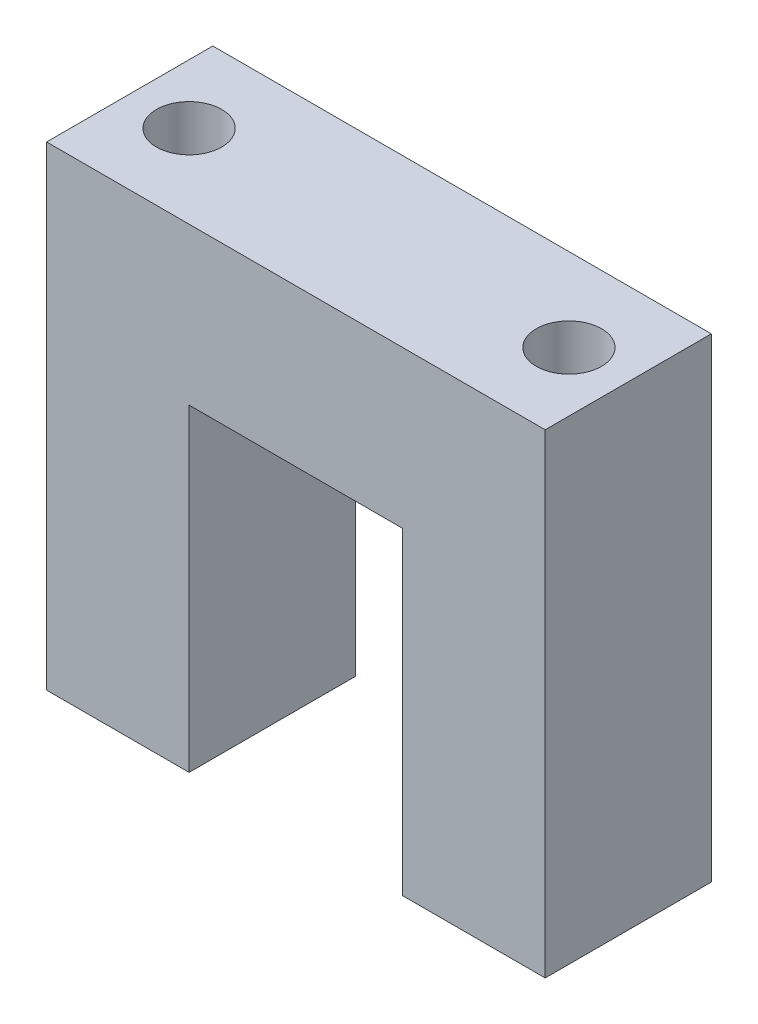
ISO-10303-21;
HEADER;
FILE_DESCRIPTION(('STEP AP214'),'2;1');
FILE_NAME('part.step','',(''),(''),'','','');
FILE_SCHEMA(('AUTOMOTIVE_DESIGN { 1 0 10303 214 1 1 1 1 }'));
ENDSEC;
DATA;
#1=APPLICATION_CONTEXT('core data for automotive mechanical design processes');
#2=APPLICATION_PROTOCOL_DEFINITION('international standard','automotive_design',2000,#1);
#3=PRODUCT_CONTEXT('',#1,'mechanical');
#4=PRODUCT('Part','Part','',(#3));
#5=PRODUCT_RELATED_PRODUCT_CATEGORY('part','',(#4));
#6=PRODUCT_DEFINITION_FORMATION('','',#4);
#7=PRODUCT_DEFINITION_CONTEXT('part definition',#1,'design');
#8=PRODUCT_DEFINITION('design','',#6,#7);
#9=PRODUCT_DEFINITION_SHAPE('','',#8);
#10=(LENGTH_UNIT() NAMED_UNIT(*) SI_UNIT(.MILLI.,.METRE.));
#11=(NAMED_UNIT(*) PLANE_ANGLE_UNIT() SI_UNIT($,.RADIAN.));
#12=(NAMED_UNIT(*) SI_UNIT($,.STERADIAN.) SOLID_ANGLE_UNIT());
#13=UNCERTAINTY_MEASURE_WITH_UNIT(LENGTH_MEASURE(1.E-05),#10,'distance_accuracy_value','');
#14=(GEOMETRIC_REPRESENTATION_CONTEXT(3) GLOBAL_UNCERTAINTY_ASSIGNED_CONTEXT((#13)) GLOBAL_UNIT_ASSIGNED_CONTEXT((#10,
#11,#12)) REPRESENTATION_CONTEXT('',''));
#15=CARTESIAN_POINT('',(0.,0.,0.));
#16=DIRECTION('',(0.,0.,1.));
#17=DIRECTION('',(1.,0.,0.));
#18=AXIS2_PLACEMENT_3D('',#15,#16,#17);
#19=CARTESIAN_POINT('',(-9.,26.8,7.));
#20=DIRECTION('',(-1.,0.,0.));
#21=DIRECTION('',(0.,-1.,0.));
#22=AXIS2_PLACEMENT_3D('',#19,#20,#21);
#23=PLANE('',#22);
#24=DIRECTION('',(0.,1.,0.));
#25=VECTOR('',#24,1.);
#26=CARTESIAN_POINT('',(-9.,26.8,-7.));
#27=LINE('',#26,#25);
#28=CARTESIAN_POINT('',(-9.,0.,-7.));
#29=VERTEX_POINT('',#28);
#30=CARTESIAN_POINT('',(-9.,26.8,-7.));
#31=VERTEX_POINT('',#30);
#32=EDGE_CURVE('E128',#29,#31,#27,.T.);
#33=ORIENTED_EDGE('',*,*,#32,.T.);
#34=DIRECTION('',(0.,0.,-1.));
#35=VECTOR('',#34,1.);
#36=CARTESIAN_POINT('',(-9.,26.8,7.));
#37=LINE('',#36,#35);
#38=CARTESIAN_POINT('',(-9.,26.8,7.));
#39=VERTEX_POINT('',#38);
#40=EDGE_CURVE('E11',#39,#31,#37,.T.);
#41=ORIENTED_EDGE('',*,*,#40,.F.);
#42=DIRECTION('',(0.,1.,0.));
#43=VECTOR('',#42,1.);
#44=CARTESIAN_POINT('',(-9.,26.8,7.));
#45=LINE('',#44,#43);
#46=CARTESIAN_POINT('',(-9.,0.,7.));
#47=VERTEX_POINT('',#46);
#48=EDGE_CURVE('E143',#47,#39,#45,.T.);
#49=ORIENTED_EDGE('',*,*,#48,.F.);
#50=DIRECTION('',(0.,0.,-1.));
#51=VECTOR('',#50,1.);
#52=CARTESIAN_POINT('',(-9.,0.,7.));
#53=LINE('',#52,#51);
#54=EDGE_CURVE('E124',#47,#29,#53,.T.);
#55=ORIENTED_EDGE('',*,*,#54,.T.);
#56=EDGE_LOOP('',(#33,#41,#49,#55));
#57=FACE_BOUND('',#56,.T.);
#58=ADVANCED_FACE('F32',(#57),#23,.F.);
#59=CARTESIAN_POINT('',(9.,26.8,7.));
#60=DIRECTION('',(0.,1.,0.));
#61=DIRECTION('',(0.,0.,1.));
#62=AXIS2_PLACEMENT_3D('',#59,#60,#61);
#63=PLANE('',#62);
#64=DIRECTION('',(1.,0.,0.));
#65=VECTOR('',#64,1.);
#66=CARTESIAN_POINT('',(9.,26.8,-7.));
#67=LINE('',#66,#65);
#68=CARTESIAN_POINT('',(9.,26.8,-7.));
#69=VERTEX_POINT('',#68);
#70=EDGE_CURVE('E131',#31,#69,#67,.T.);
#71=ORIENTED_EDGE('',*,*,#70,.T.);
#72=DIRECTION('',(0.,0.,-1.));
#73=VECTOR('',#72,1.);
#74=CARTESIAN_POINT('',(9.,26.8,7.));
#75=LINE('',#74,#73);
#76=CARTESIAN_POINT('',(9.,26.8,7.));
#77=VERTEX_POINT('',#76);
#78=EDGE_CURVE('E40',#77,#69,#75,.T.);
#79=ORIENTED_EDGE('',*,*,#78,.F.);
#80=DIRECTION('',(1.,0.,0.));
#81=VECTOR('',#80,1.);
#82=CARTESIAN_POINT('',(9.,26.8,7.));
#83=LINE('',#82,#81);
#84=EDGE_CURVE('E91',#39,#77,#83,.T.);
#85=ORIENTED_EDGE('',*,*,#84,.F.);
#86=ORIENTED_EDGE('',*,*,#40,.T.);
#87=EDGE_LOOP('',(#71,#79,#85,#86));
#88=FACE_BOUND('',#87,.T.);
#89=ADVANCED_FACE('F206',(#88),#63,.F.);
#90=CARTESIAN_POINT('',(9.,0.,7.));
#91=DIRECTION('',(1.,0.,0.));
#92=DIRECTION('',(0.,1.,0.));
#93=AXIS2_PLACEMENT_3D('',#90,#91,#92);
#94=PLANE('',#93);
#95=DIRECTION('',(0.,-1.,0.));
#96=VECTOR('',#95,1.);
#97=CARTESIAN_POINT('',(9.,0.,-7.));
#98=LINE('',#97,#96);
#99=CARTESIAN_POINT('',(9.,0.,-7.));
#100=VERTEX_POINT('',#99);
#101=EDGE_CURVE('E134',#69,#100,#98,.T.);
#102=ORIENTED_EDGE('',*,*,#101,.T.);
#103=DIRECTION('',(0.,0.,-1.));
#104=VECTOR('',#103,1.);
#105=CARTESIAN_POINT('',(9.,0.,7.));
#106=LINE('',#105,#104);
#107=CARTESIAN_POINT('',(9.,0.,7.));
#108=VERTEX_POINT('',#107);
#109=EDGE_CURVE('E150',#108,#100,#106,.T.);
#110=ORIENTED_EDGE('',*,*,#109,.F.);
#111=DIRECTION('',(0.,-1.,0.));
#112=VECTOR('',#111,1.);
#113=CARTESIAN_POINT('',(9.,0.,7.));
#114=LINE('',#113,#112);
#115=EDGE_CURVE('E158',#77,#108,#114,.T.);
#116=ORIENTED_EDGE('',*,*,#115,.F.);
#117=ORIENTED_EDGE('',*,*,#78,.T.);
#118=EDGE_LOOP('',(#102,#110,#116,#117));
#119=FACE_BOUND('',#118,.T.);
#120=ADVANCED_FACE('F156',(#119),#94,.F.);
#121=CARTESIAN_POINT('',(21.,0.,7.));
#122=DIRECTION('',(0.,1.,0.));
#123=DIRECTION('',(-1.,0.,0.));
#124=AXIS2_PLACEMENT_3D('',#121,#122,#123);
#125=PLANE('',#124);
#126=CARTESIAN_POINT('',(16.,0.,0.));
#127=DIRECTION('',(0.,1.,0.));
#128=DIRECTION('',(-1.,0.,0.));
#129=AXIS2_PLACEMENT_3D('',#126,#127,#128);
#130=CIRCLE('',#129,2.75);
#131=CARTESIAN_POINT('',(13.25,0.,0.));
#132=VERTEX_POINT('',#131);
#133=EDGE_CURVE('E176',#132,#132,#130,.F.);
#134=ORIENTED_EDGE('',*,*,#133,.F.);
#135=EDGE_LOOP('',(#134));
#136=FACE_BOUND('',#135,.T.);
#137=DIRECTION('',(1.,0.,0.));
#138=VECTOR('',#137,1.);
#139=CARTESIAN_POINT('',(21.,0.,-7.));
#140=LINE('',#139,#138);
#141=CARTESIAN_POINT('',(21.,0.,-7.));
#142=VERTEX_POINT('',#141);
#143=EDGE_CURVE('E136',#100,#142,#140,.T.);
#144=ORIENTED_EDGE('',*,*,#143,.T.);
#145=DIRECTION('',(0.,0.,-1.));
#146=VECTOR('',#145,1.);
#147=CARTESIAN_POINT('',(21.,0.,7.));
#148=LINE('',#147,#146);
#149=CARTESIAN_POINT('',(21.,0.,7.));
#150=VERTEX_POINT('',#149);
#151=EDGE_CURVE('E147',#150,#142,#148,.T.);
#152=ORIENTED_EDGE('',*,*,#151,.F.);
#153=DIRECTION('',(1.,0.,0.));
#154=VECTOR('',#153,1.);
#155=CARTESIAN_POINT('',(21.,0.,7.));
#156=LINE('',#155,#154);
#157=EDGE_CURVE('E170',#108,#150,#156,.T.);
#158=ORIENTED_EDGE('',*,*,#157,.F.);
#159=ORIENTED_EDGE('',*,*,#109,.T.);
#160=EDGE_LOOP('',(#144,#152,#158,#159));
#161=FACE_BOUND('',#160,.T.);
#162=ADVANCED_FACE('F166',(#136,#161),#125,.F.);
#163=CARTESIAN_POINT('',(21.,40.,7.));
#164=DIRECTION('',(-1.,0.,0.));
#165=DIRECTION('',(0.,0.,1.));
#166=AXIS2_PLACEMENT_3D('',#163,#164,#165);
#167=PLANE('',#166);
#168=DIRECTION('',(0.,1.,0.));
#169=VECTOR('',#168,1.);
#170=CARTESIAN_POINT('',(21.,40.,-7.));
#171=LINE('',#170,#169);
#172=CARTESIAN_POINT('',(21.,40.,-7.));
#173=VERTEX_POINT('',#172);
#174=EDGE_CURVE('E138',#142,#173,#171,.T.);
#175=ORIENTED_EDGE('',*,*,#174,.T.);
#176=DIRECTION('',(0.,0.,-1.));
#177=VECTOR('',#176,1.);
#178=CARTESIAN_POINT('',(21.,40.,7.));
#179=LINE('',#178,#177);
#180=CARTESIAN_POINT('',(21.,40.,7.));
#181=VERTEX_POINT('',#180);
#182=EDGE_CURVE('E119',#181,#173,#179,.T.);
#183=ORIENTED_EDGE('',*,*,#182,.F.);
#184=DIRECTION('',(0.,1.,0.));
#185=VECTOR('',#184,1.);
#186=CARTESIAN_POINT('',(21.,40.,7.));
#187=LINE('',#186,#185);
#188=EDGE_CURVE('E110',#150,#181,#187,.T.);
#189=ORIENTED_EDGE('',*,*,#188,.F.);
#190=ORIENTED_EDGE('',*,*,#151,.T.);
#191=EDGE_LOOP('',(#175,#183,#189,#190));
#192=FACE_BOUND('',#191,.T.);
#193=ADVANCED_FACE('F169',(#192),#167,.F.);
#194=CARTESIAN_POINT('',(-21.,40.,7.));
#195=DIRECTION('',(0.,-1.,0.));
#196=DIRECTION('',(0.,0.,-1.));
#197=AXIS2_PLACEMENT_3D('',#194,#195,#196);
#198=PLANE('',#197);
#199=CARTESIAN_POINT('',(-16.,40.,0.));
#200=DIRECTION('',(0.,1.,0.));
#201=DIRECTION('',(0.,0.,1.));
#202=AXIS2_PLACEMENT_3D('',#199,#200,#201);
#203=CIRCLE('',#202,2.75);
#204=CARTESIAN_POINT('',(-16.,40.,2.75));
#205=VERTEX_POINT('',#204);
#206=EDGE_CURVE('E179',#205,#205,#203,.T.);
#207=ORIENTED_EDGE('',*,*,#206,.F.);
#208=EDGE_LOOP('',(#207));
#209=FACE_BOUND('',#208,.T.);
#210=CARTESIAN_POINT('',(16.,40.,0.));
#211=DIRECTION('',(0.,1.,0.));
#212=DIRECTION('',(0.,0.,1.));
#213=AXIS2_PLACEMENT_3D('',#210,#211,#212);
#214=CIRCLE('',#213,2.75);
#215=CARTESIAN_POINT('',(16.,40.,2.75));
#216=VERTEX_POINT('',#215);
#217=EDGE_CURVE('E180',#216,#216,#214,.T.);
#218=ORIENTED_EDGE('',*,*,#217,.F.);
#219=EDGE_LOOP('',(#218));
#220=FACE_BOUND('',#219,.T.);
#221=DIRECTION('',(-1.,0.,0.));
#222=VECTOR('',#221,1.);
#223=CARTESIAN_POINT('',(-21.,40.,-7.));
#224=LINE('',#223,#222);
#225=CARTESIAN_POINT('',(-21.,40.,-7.));
#226=VERTEX_POINT('',#225);
#227=EDGE_CURVE('E118',#173,#226,#224,.T.);
#228=ORIENTED_EDGE('',*,*,#227,.T.);
#229=DIRECTION('',(0.,0.,-1.));
#230=VECTOR('',#229,1.);
#231=CARTESIAN_POINT('',(-21.,40.,7.));
#232=LINE('',#231,#230);
#233=CARTESIAN_POINT('',(-21.,40.,7.));
#234=VERTEX_POINT('',#233);
#235=EDGE_CURVE('E115',#234,#226,#232,.T.);
#236=ORIENTED_EDGE('',*,*,#235,.F.);
#237=DIRECTION('',(-1.,0.,0.));
#238=VECTOR('',#237,1.);
#239=CARTESIAN_POINT('',(-21.,40.,7.));
#240=LINE('',#239,#238);
#241=EDGE_CURVE('E104',#181,#234,#240,.T.);
#242=ORIENTED_EDGE('',*,*,#241,.F.);
#243=ORIENTED_EDGE('',*,*,#182,.T.);
#244=EDGE_LOOP('',(#228,#236,#242,#243));
#245=FACE_BOUND('',#244,.T.);
#246=ADVANCED_FACE('F116',(#209,#220,#245),#198,.F.);
#247=CARTESIAN_POINT('',(-21.,0.,7.));
#248=DIRECTION('',(1.,0.,0.));
#249=DIRECTION('',(0.,0.,-1.));
#250=AXIS2_PLACEMENT_3D('',#247,#248,#249);
#251=PLANE('',#250);
#252=DIRECTION('',(0.,-1.,0.));
#253=VECTOR('',#252,1.);
#254=CARTESIAN_POINT('',(-21.,0.,-7.));
#255=LINE('',#254,#253);
#256=CARTESIAN_POINT('',(-21.,0.,-7.));
#257=VERTEX_POINT('',#256);
#258=EDGE_CURVE('E77',#226,#257,#255,.T.);
#259=ORIENTED_EDGE('',*,*,#258,.T.);
#260=DIRECTION('',(0.,0.,-1.));
#261=VECTOR('',#260,1.);
#262=CARTESIAN_POINT('',(-21.,0.,7.));
#263=LINE('',#262,#261);
#264=CARTESIAN_POINT('',(-21.,0.,7.));
#265=VERTEX_POINT('',#264);
#266=EDGE_CURVE('E120',#265,#257,#263,.T.);
#267=ORIENTED_EDGE('',*,*,#266,.F.);
#268=DIRECTION('',(0.,-1.,0.));
#269=VECTOR('',#268,1.);
#270=CARTESIAN_POINT('',(-21.,0.,7.));
#271=LINE('',#270,#269);
#272=EDGE_CURVE('E108',#234,#265,#271,.T.);
#273=ORIENTED_EDGE('',*,*,#272,.F.);
#274=ORIENTED_EDGE('',*,*,#235,.T.);
#275=EDGE_LOOP('',(#259,#267,#273,#274));
#276=FACE_BOUND('',#275,.T.);
#277=ADVANCED_FACE('F122',(#276),#251,.F.);
#278=CARTESIAN_POINT('',(-9.,0.,7.));
#279=DIRECTION('',(0.,1.,0.));
#280=DIRECTION('',(-1.,0.,0.));
#281=AXIS2_PLACEMENT_3D('',#278,#279,#280);
#282=PLANE('',#281);
#283=CARTESIAN_POINT('',(-16.,0.,0.));
#284=DIRECTION('',(0.,1.,0.));
#285=DIRECTION('',(-1.,0.,0.));
#286=AXIS2_PLACEMENT_3D('',#283,#284,#285);
#287=CIRCLE('',#286,2.75);
#288=CARTESIAN_POINT('',(-18.75,0.,0.));
#289=VERTEX_POINT('',#288);
#290=EDGE_CURVE('E132',#289,#289,#287,.F.);
#291=ORIENTED_EDGE('',*,*,#290,.F.);
#292=EDGE_LOOP('',(#291));
#293=FACE_BOUND('',#292,.T.);
#294=DIRECTION('',(1.,0.,0.));
#295=VECTOR('',#294,1.);
#296=CARTESIAN_POINT('',(-9.,0.,-7.));
#297=LINE('',#296,#295);
#298=EDGE_CURVE('E83',#257,#29,#297,.T.);
#299=ORIENTED_EDGE('',*,*,#298,.T.);
#300=ORIENTED_EDGE('',*,*,#54,.F.);
#301=DIRECTION('',(1.,0.,0.));
#302=VECTOR('',#301,1.);
#303=CARTESIAN_POINT('',(-9.,0.,7.));
#304=LINE('',#303,#302);
#305=EDGE_CURVE('E48',#265,#47,#304,.T.);
#306=ORIENTED_EDGE('',*,*,#305,.F.);
#307=ORIENTED_EDGE('',*,*,#266,.T.);
#308=EDGE_LOOP('',(#299,#300,#306,#307));
#309=FACE_BOUND('',#308,.T.);
#310=ADVANCED_FACE('F213',(#293,#309),#282,.F.);
#311=CARTESIAN_POINT('',(0.,0.,7.));
#312=DIRECTION('',(0.,0.,-1.));
#313=DIRECTION('',(-1.,0.,0.));
#314=AXIS2_PLACEMENT_3D('',#311,#312,#313);
#315=PLANE('',#314);
#316=ORIENTED_EDGE('',*,*,#48,.T.);
#317=ORIENTED_EDGE('',*,*,#84,.T.);
#318=ORIENTED_EDGE('',*,*,#115,.T.);
#319=ORIENTED_EDGE('',*,*,#157,.T.);
#320=ORIENTED_EDGE('',*,*,#188,.T.);
#321=ORIENTED_EDGE('',*,*,#241,.T.);
#322=ORIENTED_EDGE('',*,*,#272,.T.);
#323=ORIENTED_EDGE('',*,*,#305,.T.);
#324=EDGE_LOOP('',(#316,#317,#318,#319,#320,#321,#322,#323));
#325=FACE_BOUND('',#324,.T.);
#326=ADVANCED_FACE('F106',(#325),#315,.F.);
#327=CARTESIAN_POINT('',(0.,0.,-7.));
#328=DIRECTION('',(0.,0.,-1.));
#329=DIRECTION('',(-1.,0.,0.));
#330=AXIS2_PLACEMENT_3D('',#327,#328,#329);
#331=PLANE('',#330);
#332=ORIENTED_EDGE('',*,*,#32,.F.);
#333=ORIENTED_EDGE('',*,*,#298,.F.);
#334=ORIENTED_EDGE('',*,*,#258,.F.);
#335=ORIENTED_EDGE('',*,*,#227,.F.);
#336=ORIENTED_EDGE('',*,*,#174,.F.);
#337=ORIENTED_EDGE('',*,*,#143,.F.);
#338=ORIENTED_EDGE('',*,*,#101,.F.);
#339=ORIENTED_EDGE('',*,*,#70,.F.);
#340=EDGE_LOOP('',(#332,#333,#334,#335,#336,#337,#338,#339));
#341=FACE_BOUND('',#340,.T.);
#342=ADVANCED_FACE('F162',(#341),#331,.T.);
#343=CARTESIAN_POINT('',(-16.,-7.77817459305201,0.));
#344=DIRECTION('',(0.,1.,0.));
#345=DIRECTION('',(0.,0.,1.));
#346=AXIS2_PLACEMENT_3D('',#343,#344,#345);
#347=CYLINDRICAL_SURFACE('',#346,2.75);
#348=ORIENTED_EDGE('',*,*,#290,.T.);
#349=EDGE_LOOP('',(#348));
#350=FACE_BOUND('',#349,.T.);
#351=ORIENTED_EDGE('',*,*,#206,.T.);
#352=EDGE_LOOP('',(#351));
#353=FACE_BOUND('',#352,.T.);
#354=ADVANCED_FACE('F188',(#350,#353),#347,.F.);
#355=CARTESIAN_POINT('',(16.,-7.77817459305201,0.));
#356=DIRECTION('',(0.,1.,0.));
#357=DIRECTION('',(0.,0.,1.));
#358=AXIS2_PLACEMENT_3D('',#355,#356,#357);
#359=CYLINDRICAL_SURFACE('',#358,2.75);
#360=ORIENTED_EDGE('',*,*,#133,.T.);
#361=EDGE_LOOP('',(#360));
#362=FACE_BOUND('',#361,.T.);
#363=ORIENTED_EDGE('',*,*,#217,.T.);
#364=EDGE_LOOP('',(#363));
#365=FACE_BOUND('',#364,.T.);
#366=ADVANCED_FACE('F195',(#362,#365),#359,.F.);
#367=CLOSED_SHELL('',(#58,#89,#120,#162,#193,#246,#277,#310,#326,#342,#354,#366));
#368=MANIFOLD_SOLID_BREP('B2',#367);
#369=ADVANCED_BREP_SHAPE_REPRESENTATION('',(#18,#368),#14);
#370=SHAPE_DEFINITION_REPRESENTATION(#9,#369);
ENDSEC;
END-ISO-10303-21;
